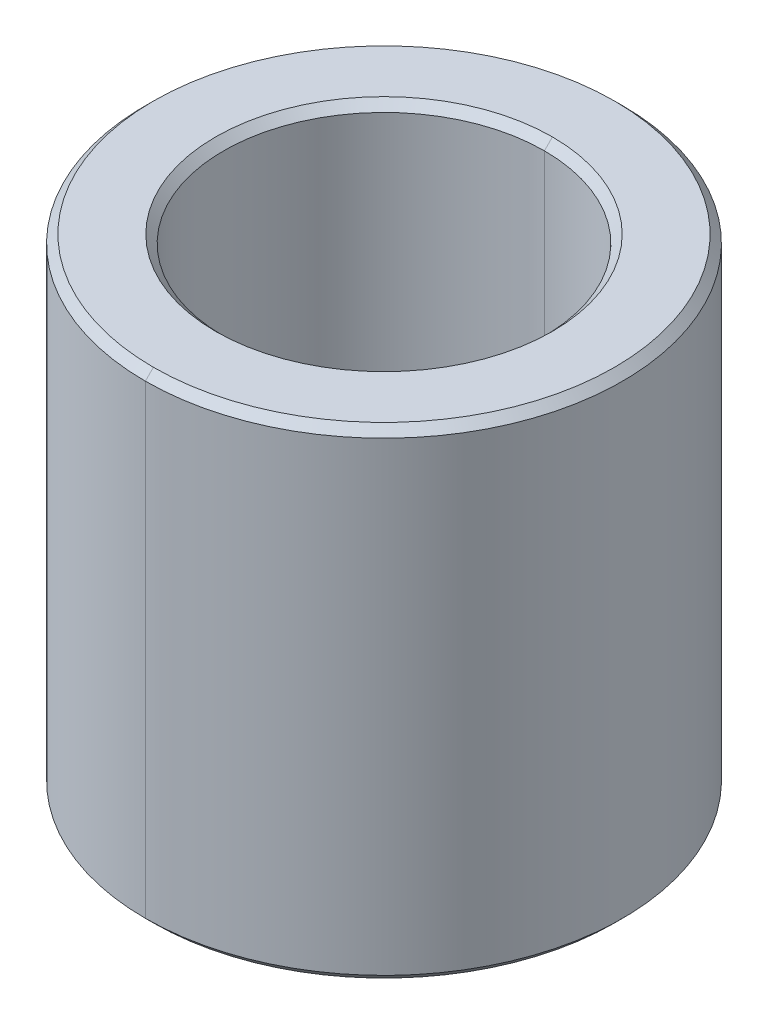
ISO-10303-21;
HEADER;
FILE_DESCRIPTION(('STEP AP214'),'2;1');
FILE_NAME('part.step','',(''),(''),'','','');
FILE_SCHEMA(('AUTOMOTIVE_DESIGN { 1 0 10303 214 1 1 1 1 }'));
ENDSEC;
DATA;
#1=APPLICATION_CONTEXT('core data for automotive mechanical design processes');
#2=APPLICATION_PROTOCOL_DEFINITION('international standard','automotive_design',2000,#1);
#3=PRODUCT_CONTEXT('',#1,'mechanical');
#4=PRODUCT('Part','Part','',(#3));
#5=PRODUCT_RELATED_PRODUCT_CATEGORY('part','',(#4));
#6=PRODUCT_DEFINITION_FORMATION('','',#4);
#7=PRODUCT_DEFINITION_CONTEXT('part definition',#1,'design');
#8=PRODUCT_DEFINITION('design','',#6,#7);
#9=PRODUCT_DEFINITION_SHAPE('','',#8);
#10=(LENGTH_UNIT() NAMED_UNIT(*) SI_UNIT(.MILLI.,.METRE.));
#11=(NAMED_UNIT(*) PLANE_ANGLE_UNIT() SI_UNIT($,.RADIAN.));
#12=(NAMED_UNIT(*) SI_UNIT($,.STERADIAN.) SOLID_ANGLE_UNIT());
#13=UNCERTAINTY_MEASURE_WITH_UNIT(LENGTH_MEASURE(1.E-05),#10,'distance_accuracy_value','');
#14=(GEOMETRIC_REPRESENTATION_CONTEXT(3) GLOBAL_UNCERTAINTY_ASSIGNED_CONTEXT((#13)) GLOBAL_UNIT_ASSIGNED_CONTEXT((#10,
#11,#12)) REPRESENTATION_CONTEXT('',''));
#15=CARTESIAN_POINT('',(0.,0.,0.));
#16=DIRECTION('',(0.,0.,1.));
#17=DIRECTION('',(1.,0.,0.));
#18=AXIS2_PLACEMENT_3D('',#15,#16,#17);
#19=CARTESIAN_POINT('',(0.,2.9,0.));
#20=DIRECTION('',(0.,1.,0.));
#21=DIRECTION('',(0.,0.,1.));
#22=AXIS2_PLACEMENT_3D('',#19,#20,#21);
#23=CONICAL_SURFACE('',#22,2.,0.78539816339745);
#24=DIRECTION('',(0.,0.707106781186546,-0.707106781186549));
#25=VECTOR('',#24,1.);
#26=CARTESIAN_POINT('',(0.,2.9,-2.));
#27=LINE('',#26,#25);
#28=CARTESIAN_POINT('',(0.,2.9,-2.));
#29=VERTEX_POINT('',#28);
#30=CARTESIAN_POINT('',(0.,3.,-2.1));
#31=VERTEX_POINT('',#30);
#32=EDGE_CURVE('E191',#29,#31,#27,.T.);
#33=ORIENTED_EDGE('',*,*,#32,.F.);
#34=CARTESIAN_POINT('',(0.,2.9,0.));
#35=DIRECTION('',(0.,1.,0.));
#36=DIRECTION('',(0.,0.,1.));
#37=AXIS2_PLACEMENT_3D('',#34,#35,#36);
#38=CIRCLE('',#37,2.);
#39=CARTESIAN_POINT('',(0.,2.9,2.));
#40=VERTEX_POINT('',#39);
#41=EDGE_CURVE('E25',#40,#29,#38,.T.);
#42=ORIENTED_EDGE('',*,*,#41,.F.);
#43=DIRECTION('',(0.,0.707106781186546,0.707106781186549));
#44=VECTOR('',#43,1.);
#45=CARTESIAN_POINT('',(0.,2.9,2.));
#46=LINE('',#45,#44);
#47=CARTESIAN_POINT('',(0.,3.,2.1));
#48=VERTEX_POINT('',#47);
#49=EDGE_CURVE('E162',#40,#48,#46,.T.);
#50=ORIENTED_EDGE('',*,*,#49,.T.);
#51=CARTESIAN_POINT('',(0.,3.,0.));
#52=DIRECTION('',(0.,-1.,0.));
#53=DIRECTION('',(0.,0.,1.));
#54=AXIS2_PLACEMENT_3D('',#51,#52,#53);
#55=CIRCLE('',#54,2.1);
#56=EDGE_CURVE('E18',#31,#48,#55,.T.);
#57=ORIENTED_EDGE('',*,*,#56,.F.);
#58=EDGE_LOOP('',(#33,#42,#50,#57));
#59=FACE_BOUND('',#58,.T.);
#60=ADVANCED_FACE('F14',(#59),#23,.F.);
#61=CARTESIAN_POINT('',(0.,-3.,0.));
#62=DIRECTION('',(0.,-1.,0.));
#63=DIRECTION('',(0.,0.,-1.));
#64=AXIS2_PLACEMENT_3D('',#61,#62,#63);
#65=CONICAL_SURFACE('',#64,2.1,0.785398163397448);
#66=DIRECTION('',(0.,-0.707106781186548,0.707106781186548));
#67=VECTOR('',#66,1.);
#68=CARTESIAN_POINT('',(0.,-3.,2.1));
#69=LINE('',#68,#67);
#70=CARTESIAN_POINT('',(0.,-2.9,2.));
#71=VERTEX_POINT('',#70);
#72=CARTESIAN_POINT('',(0.,-3.,2.1));
#73=VERTEX_POINT('',#72);
#74=EDGE_CURVE('E169',#71,#73,#69,.T.);
#75=ORIENTED_EDGE('',*,*,#74,.F.);
#76=CARTESIAN_POINT('',(0.,-2.9,0.));
#77=DIRECTION('',(0.,-1.,0.));
#78=DIRECTION('',(0.,0.,1.));
#79=AXIS2_PLACEMENT_3D('',#76,#77,#78);
#80=CIRCLE('',#79,2.);
#81=CARTESIAN_POINT('',(0.,-2.9,-2.));
#82=VERTEX_POINT('',#81);
#83=EDGE_CURVE('E9',#82,#71,#80,.T.);
#84=ORIENTED_EDGE('',*,*,#83,.F.);
#85=DIRECTION('',(0.,-0.707106781186548,-0.707106781186548));
#86=VECTOR('',#85,1.);
#87=CARTESIAN_POINT('',(0.,-3.,-2.1));
#88=LINE('',#87,#86);
#89=CARTESIAN_POINT('',(0.,-3.,-2.1));
#90=VERTEX_POINT('',#89);
#91=EDGE_CURVE('E122',#82,#90,#88,.T.);
#92=ORIENTED_EDGE('',*,*,#91,.T.);
#93=CARTESIAN_POINT('',(0.,-3.,0.));
#94=DIRECTION('',(0.,1.,0.));
#95=DIRECTION('',(0.,0.,1.));
#96=AXIS2_PLACEMENT_3D('',#93,#94,#95);
#97=CIRCLE('',#96,2.1);
#98=EDGE_CURVE('E144',#73,#90,#97,.T.);
#99=ORIENTED_EDGE('',*,*,#98,.F.);
#100=EDGE_LOOP('',(#75,#84,#92,#99));
#101=FACE_BOUND('',#100,.T.);
#102=ADVANCED_FACE('F224',(#101),#65,.F.);
#103=CARTESIAN_POINT('',(0.,3.,0.));
#104=DIRECTION('',(0.,-1.,0.));
#105=DIRECTION('',(0.,0.,-1.));
#106=AXIS2_PLACEMENT_3D('',#103,#104,#105);
#107=CONICAL_SURFACE('',#106,2.875,0.785398163397452);
#108=DIRECTION('',(0.,-0.707106781186544,0.707106781186551));
#109=VECTOR('',#108,1.);
#110=CARTESIAN_POINT('',(0.,3.,2.875));
#111=LINE('',#110,#109);
#112=CARTESIAN_POINT('',(0.,3.,2.875));
#113=VERTEX_POINT('',#112);
#114=CARTESIAN_POINT('',(0.,2.9,2.975));
#115=VERTEX_POINT('',#114);
#116=EDGE_CURVE('E105',#113,#115,#111,.T.);
#117=ORIENTED_EDGE('',*,*,#116,.F.);
#118=CARTESIAN_POINT('',(0.,3.,0.));
#119=DIRECTION('',(0.,1.,0.));
#120=DIRECTION('',(0.,0.,1.));
#121=AXIS2_PLACEMENT_3D('',#118,#119,#120);
#122=CIRCLE('',#121,2.875);
#123=CARTESIAN_POINT('',(0.,3.,-2.875));
#124=VERTEX_POINT('',#123);
#125=EDGE_CURVE('E99',#124,#113,#122,.T.);
#126=ORIENTED_EDGE('',*,*,#125,.F.);
#127=DIRECTION('',(0.,-0.707106781186544,-0.707106781186551));
#128=VECTOR('',#127,1.);
#129=CARTESIAN_POINT('',(0.,3.,-2.875));
#130=LINE('',#129,#128);
#131=CARTESIAN_POINT('',(0.,2.9,-2.975));
#132=VERTEX_POINT('',#131);
#133=EDGE_CURVE('E102',#124,#132,#130,.T.);
#134=ORIENTED_EDGE('',*,*,#133,.T.);
#135=CARTESIAN_POINT('',(0.,2.9,0.));
#136=DIRECTION('',(0.,-1.,0.));
#137=DIRECTION('',(0.,0.,1.));
#138=AXIS2_PLACEMENT_3D('',#135,#136,#137);
#139=CIRCLE('',#138,2.975);
#140=EDGE_CURVE('E147',#115,#132,#139,.T.);
#141=ORIENTED_EDGE('',*,*,#140,.F.);
#142=EDGE_LOOP('',(#117,#126,#134,#141));
#143=FACE_BOUND('',#142,.T.);
#144=ADVANCED_FACE('F101',(#143),#107,.T.);
#145=CARTESIAN_POINT('',(0.,-2.9,0.));
#146=DIRECTION('',(0.,1.,0.));
#147=DIRECTION('',(0.,0.,1.));
#148=AXIS2_PLACEMENT_3D('',#145,#146,#147);
#149=CONICAL_SURFACE('',#148,2.975,0.785398163397446);
#150=DIRECTION('',(0.,0.707106781186549,-0.707106781186546));
#151=VECTOR('',#150,1.);
#152=CARTESIAN_POINT('',(0.,-2.9,-2.975));
#153=LINE('',#152,#151);
#154=CARTESIAN_POINT('',(0.,-3.,-2.875));
#155=VERTEX_POINT('',#154);
#156=CARTESIAN_POINT('',(0.,-2.9,-2.975));
#157=VERTEX_POINT('',#156);
#158=EDGE_CURVE('E151',#155,#157,#153,.T.);
#159=ORIENTED_EDGE('',*,*,#158,.F.);
#160=CARTESIAN_POINT('',(0.,-3.,0.));
#161=DIRECTION('',(0.,-1.,0.));
#162=DIRECTION('',(0.,0.,1.));
#163=AXIS2_PLACEMENT_3D('',#160,#161,#162);
#164=CIRCLE('',#163,2.875);
#165=CARTESIAN_POINT('',(0.,-3.,2.875));
#166=VERTEX_POINT('',#165);
#167=EDGE_CURVE('E148',#166,#155,#164,.T.);
#168=ORIENTED_EDGE('',*,*,#167,.F.);
#169=DIRECTION('',(0.,0.707106781186549,0.707106781186546));
#170=VECTOR('',#169,1.);
#171=CARTESIAN_POINT('',(0.,-2.9,2.975));
#172=LINE('',#171,#170);
#173=CARTESIAN_POINT('',(0.,-2.9,2.975));
#174=VERTEX_POINT('',#173);
#175=EDGE_CURVE('E135',#166,#174,#172,.T.);
#176=ORIENTED_EDGE('',*,*,#175,.T.);
#177=CARTESIAN_POINT('',(0.,-2.9,0.));
#178=DIRECTION('',(0.,1.,0.));
#179=DIRECTION('',(0.,0.,1.));
#180=AXIS2_PLACEMENT_3D('',#177,#178,#179);
#181=CIRCLE('',#180,2.975);
#182=EDGE_CURVE('E39',#157,#174,#181,.T.);
#183=ORIENTED_EDGE('',*,*,#182,.F.);
#184=EDGE_LOOP('',(#159,#168,#176,#183));
#185=FACE_BOUND('',#184,.T.);
#186=ADVANCED_FACE('F235',(#185),#149,.T.);
#187=CARTESIAN_POINT('',(0.,3.,0.));
#188=DIRECTION('',(0.,-1.,0.));
#189=DIRECTION('',(0.,0.,-1.));
#190=AXIS2_PLACEMENT_3D('',#187,#188,#189);
#191=CYLINDRICAL_SURFACE('',#190,2.);
#192=DIRECTION('',(0.,-1.,0.));
#193=VECTOR('',#192,1.);
#194=CARTESIAN_POINT('',(0.,3.,2.));
#195=LINE('',#194,#193);
#196=EDGE_CURVE('E138',#40,#71,#195,.T.);
#197=ORIENTED_EDGE('',*,*,#196,.F.);
#198=ORIENTED_EDGE('',*,*,#41,.T.);
#199=DIRECTION('',(0.,-1.,0.));
#200=VECTOR('',#199,1.);
#201=CARTESIAN_POINT('',(0.,3.,-2.));
#202=LINE('',#201,#200);
#203=EDGE_CURVE('E143',#29,#82,#202,.T.);
#204=ORIENTED_EDGE('',*,*,#203,.T.);
#205=ORIENTED_EDGE('',*,*,#83,.T.);
#206=EDGE_LOOP('',(#197,#198,#204,#205));
#207=FACE_BOUND('',#206,.T.);
#208=ADVANCED_FACE('F219',(#207),#191,.F.);
#209=CARTESIAN_POINT('',(0.,3.,0.));
#210=DIRECTION('',(0.,-1.,0.));
#211=DIRECTION('',(0.,0.,-1.));
#212=AXIS2_PLACEMENT_3D('',#209,#210,#211);
#213=CYLINDRICAL_SURFACE('',#212,2.975);
#214=DIRECTION('',(0.,-1.,0.));
#215=VECTOR('',#214,1.);
#216=CARTESIAN_POINT('',(0.,3.,2.975));
#217=LINE('',#216,#215);
#218=EDGE_CURVE('E192',#115,#174,#217,.T.);
#219=ORIENTED_EDGE('',*,*,#218,.F.);
#220=ORIENTED_EDGE('',*,*,#140,.T.);
#221=DIRECTION('',(0.,-1.,0.));
#222=VECTOR('',#221,1.);
#223=CARTESIAN_POINT('',(0.,3.,-2.975));
#224=LINE('',#223,#222);
#225=EDGE_CURVE('E110',#132,#157,#224,.T.);
#226=ORIENTED_EDGE('',*,*,#225,.T.);
#227=ORIENTED_EDGE('',*,*,#182,.T.);
#228=EDGE_LOOP('',(#219,#220,#226,#227));
#229=FACE_BOUND('',#228,.T.);
#230=ADVANCED_FACE('F228',(#229),#213,.T.);
#231=CARTESIAN_POINT('',(0.,-3.,0.));
#232=DIRECTION('',(0.,1.,0.));
#233=DIRECTION('',(1.,0.,0.));
#234=AXIS2_PLACEMENT_3D('',#231,#232,#233);
#235=PLANE('',#234);
#236=CARTESIAN_POINT('',(0.,-3.,0.));
#237=DIRECTION('',(0.,1.,0.));
#238=DIRECTION('',(0.,0.,1.));
#239=AXIS2_PLACEMENT_3D('',#236,#237,#238);
#240=CIRCLE('',#239,2.1);
#241=EDGE_CURVE('E131',#90,#73,#240,.T.);
#242=ORIENTED_EDGE('',*,*,#241,.T.);
#243=ORIENTED_EDGE('',*,*,#98,.T.);
#244=EDGE_LOOP('',(#242,#243));
#245=FACE_BOUND('',#244,.T.);
#246=ORIENTED_EDGE('',*,*,#167,.T.);
#247=CARTESIAN_POINT('',(0.,-3.,0.));
#248=DIRECTION('',(0.,-1.,0.));
#249=DIRECTION('',(0.,0.,1.));
#250=AXIS2_PLACEMENT_3D('',#247,#248,#249);
#251=CIRCLE('',#250,2.875);
#252=EDGE_CURVE('E118',#155,#166,#251,.T.);
#253=ORIENTED_EDGE('',*,*,#252,.T.);
#254=EDGE_LOOP('',(#246,#253));
#255=FACE_BOUND('',#254,.T.);
#256=ADVANCED_FACE('F225',(#245,#255),#235,.F.);
#257=CARTESIAN_POINT('',(0.,3.,0.));
#258=DIRECTION('',(0.,1.,0.));
#259=DIRECTION('',(1.,0.,0.));
#260=AXIS2_PLACEMENT_3D('',#257,#258,#259);
#261=PLANE('',#260);
#262=CARTESIAN_POINT('',(0.,3.,0.));
#263=DIRECTION('',(0.,-1.,0.));
#264=DIRECTION('',(0.,0.,1.));
#265=AXIS2_PLACEMENT_3D('',#262,#263,#264);
#266=CIRCLE('',#265,2.1);
#267=EDGE_CURVE('E166',#48,#31,#266,.T.);
#268=ORIENTED_EDGE('',*,*,#267,.T.);
#269=ORIENTED_EDGE('',*,*,#56,.T.);
#270=EDGE_LOOP('',(#268,#269));
#271=FACE_BOUND('',#270,.T.);
#272=ORIENTED_EDGE('',*,*,#125,.T.);
#273=CARTESIAN_POINT('',(0.,3.,0.));
#274=DIRECTION('',(0.,1.,0.));
#275=DIRECTION('',(0.,0.,1.));
#276=AXIS2_PLACEMENT_3D('',#273,#274,#275);
#277=CIRCLE('',#276,2.875);
#278=EDGE_CURVE('E114',#113,#124,#277,.T.);
#279=ORIENTED_EDGE('',*,*,#278,.T.);
#280=EDGE_LOOP('',(#272,#279));
#281=FACE_BOUND('',#280,.T.);
#282=ADVANCED_FACE('F120',(#271,#281),#261,.T.);
#283=CARTESIAN_POINT('',(0.,3.,0.));
#284=DIRECTION('',(0.,-1.,0.));
#285=DIRECTION('',(0.,0.,-1.));
#286=AXIS2_PLACEMENT_3D('',#283,#284,#285);
#287=CYLINDRICAL_SURFACE('',#286,2.975);
#288=CARTESIAN_POINT('',(0.,2.9,0.));
#289=DIRECTION('',(0.,-1.,0.));
#290=DIRECTION('',(0.,0.,1.));
#291=AXIS2_PLACEMENT_3D('',#288,#289,#290);
#292=CIRCLE('',#291,2.975);
#293=EDGE_CURVE('E116',#132,#115,#292,.T.);
#294=ORIENTED_EDGE('',*,*,#293,.T.);
#295=ORIENTED_EDGE('',*,*,#218,.T.);
#296=CARTESIAN_POINT('',(0.,-2.9,0.));
#297=DIRECTION('',(0.,1.,0.));
#298=DIRECTION('',(0.,0.,1.));
#299=AXIS2_PLACEMENT_3D('',#296,#297,#298);
#300=CIRCLE('',#299,2.975);
#301=EDGE_CURVE('E139',#174,#157,#300,.T.);
#302=ORIENTED_EDGE('',*,*,#301,.T.);
#303=ORIENTED_EDGE('',*,*,#225,.F.);
#304=EDGE_LOOP('',(#294,#295,#302,#303));
#305=FACE_BOUND('',#304,.T.);
#306=ADVANCED_FACE('F250',(#305),#287,.T.);
#307=CARTESIAN_POINT('',(0.,3.,0.));
#308=DIRECTION('',(0.,-1.,0.));
#309=DIRECTION('',(0.,0.,-1.));
#310=AXIS2_PLACEMENT_3D('',#307,#308,#309);
#311=CYLINDRICAL_SURFACE('',#310,2.);
#312=CARTESIAN_POINT('',(0.,2.9,0.));
#313=DIRECTION('',(0.,1.,0.));
#314=DIRECTION('',(0.,0.,1.));
#315=AXIS2_PLACEMENT_3D('',#312,#313,#314);
#316=CIRCLE('',#315,2.);
#317=EDGE_CURVE('E194',#29,#40,#316,.T.);
#318=ORIENTED_EDGE('',*,*,#317,.T.);
#319=ORIENTED_EDGE('',*,*,#196,.T.);
#320=CARTESIAN_POINT('',(0.,-2.9,0.));
#321=DIRECTION('',(0.,-1.,0.));
#322=DIRECTION('',(0.,0.,1.));
#323=AXIS2_PLACEMENT_3D('',#320,#321,#322);
#324=CIRCLE('',#323,2.);
#325=EDGE_CURVE('E165',#71,#82,#324,.T.);
#326=ORIENTED_EDGE('',*,*,#325,.T.);
#327=ORIENTED_EDGE('',*,*,#203,.F.);
#328=EDGE_LOOP('',(#318,#319,#326,#327));
#329=FACE_BOUND('',#328,.T.);
#330=ADVANCED_FACE('F222',(#329),#311,.F.);
#331=CARTESIAN_POINT('',(0.,-2.9,0.));
#332=DIRECTION('',(0.,1.,0.));
#333=DIRECTION('',(0.,0.,1.));
#334=AXIS2_PLACEMENT_3D('',#331,#332,#333);
#335=CONICAL_SURFACE('',#334,2.975,0.785398163397446);
#336=ORIENTED_EDGE('',*,*,#252,.F.);
#337=ORIENTED_EDGE('',*,*,#158,.T.);
#338=ORIENTED_EDGE('',*,*,#301,.F.);
#339=ORIENTED_EDGE('',*,*,#175,.F.);
#340=EDGE_LOOP('',(#336,#337,#338,#339));
#341=FACE_BOUND('',#340,.T.);
#342=ADVANCED_FACE('F16',(#341),#335,.T.);
#343=CARTESIAN_POINT('',(0.,3.,0.));
#344=DIRECTION('',(0.,-1.,0.));
#345=DIRECTION('',(0.,0.,-1.));
#346=AXIS2_PLACEMENT_3D('',#343,#344,#345);
#347=CONICAL_SURFACE('',#346,2.875,0.785398163397452);
#348=ORIENTED_EDGE('',*,*,#278,.F.);
#349=ORIENTED_EDGE('',*,*,#116,.T.);
#350=ORIENTED_EDGE('',*,*,#293,.F.);
#351=ORIENTED_EDGE('',*,*,#133,.F.);
#352=EDGE_LOOP('',(#348,#349,#350,#351));
#353=FACE_BOUND('',#352,.T.);
#354=ADVANCED_FACE('F113',(#353),#347,.T.);
#355=CARTESIAN_POINT('',(0.,-3.,0.));
#356=DIRECTION('',(0.,-1.,0.));
#357=DIRECTION('',(0.,0.,-1.));
#358=AXIS2_PLACEMENT_3D('',#355,#356,#357);
#359=CONICAL_SURFACE('',#358,2.1,0.785398163397448);
#360=ORIENTED_EDGE('',*,*,#325,.F.);
#361=ORIENTED_EDGE('',*,*,#74,.T.);
#362=ORIENTED_EDGE('',*,*,#241,.F.);
#363=ORIENTED_EDGE('',*,*,#91,.F.);
#364=EDGE_LOOP('',(#360,#361,#362,#363));
#365=FACE_BOUND('',#364,.T.);
#366=ADVANCED_FACE('F220',(#365),#359,.F.);
#367=CARTESIAN_POINT('',(0.,2.9,0.));
#368=DIRECTION('',(0.,1.,0.));
#369=DIRECTION('',(0.,0.,1.));
#370=AXIS2_PLACEMENT_3D('',#367,#368,#369);
#371=CONICAL_SURFACE('',#370,2.,0.78539816339745);
#372=ORIENTED_EDGE('',*,*,#317,.F.);
#373=ORIENTED_EDGE('',*,*,#32,.T.);
#374=ORIENTED_EDGE('',*,*,#267,.F.);
#375=ORIENTED_EDGE('',*,*,#49,.F.);
#376=EDGE_LOOP('',(#372,#373,#374,#375));
#377=FACE_BOUND('',#376,.T.);
#378=ADVANCED_FACE('F275',(#377),#371,.F.);
#379=CLOSED_SHELL('',(#60,#102,#144,#186,#208,#230,#256,#282,#306,#330,#342,#354,#366,#378));
#380=MANIFOLD_SOLID_BREP('B1',#379);
#381=ADVANCED_BREP_SHAPE_REPRESENTATION('',(#18,#380),#14);
#382=SHAPE_DEFINITION_REPRESENTATION(#9,#381);
ENDSEC;
END-ISO-10303-21;
